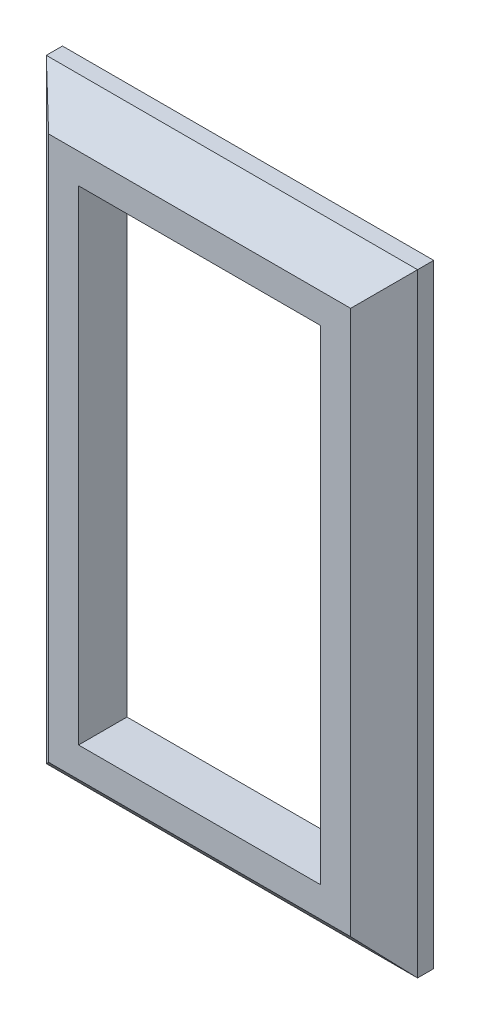
ISO-10303-21;
HEADER;
FILE_DESCRIPTION(('STEP AP214'),'2;1');
FILE_NAME('part.step','',(''),(''),'','','');
FILE_SCHEMA(('AUTOMOTIVE_DESIGN { 1 0 10303 214 1 1 1 1 }'));
ENDSEC;
DATA;
#1=APPLICATION_CONTEXT('core data for automotive mechanical design processes');
#2=APPLICATION_PROTOCOL_DEFINITION('international standard','automotive_design',2000,#1);
#3=PRODUCT_CONTEXT('',#1,'mechanical');
#4=PRODUCT('Part','Part','',(#3));
#5=PRODUCT_RELATED_PRODUCT_CATEGORY('part','',(#4));
#6=PRODUCT_DEFINITION_FORMATION('','',#4);
#7=PRODUCT_DEFINITION_CONTEXT('part definition',#1,'design');
#8=PRODUCT_DEFINITION('design','',#6,#7);
#9=PRODUCT_DEFINITION_SHAPE('','',#8);
#10=(LENGTH_UNIT() NAMED_UNIT(*) SI_UNIT(.MILLI.,.METRE.));
#11=(NAMED_UNIT(*) PLANE_ANGLE_UNIT() SI_UNIT($,.RADIAN.));
#12=(NAMED_UNIT(*) SI_UNIT($,.STERADIAN.) SOLID_ANGLE_UNIT());
#13=UNCERTAINTY_MEASURE_WITH_UNIT(LENGTH_MEASURE(1.E-05),#10,'distance_accuracy_value','');
#14=(GEOMETRIC_REPRESENTATION_CONTEXT(3) GLOBAL_UNCERTAINTY_ASSIGNED_CONTEXT((#13)) GLOBAL_UNIT_ASSIGNED_CONTEXT((#10,
#11,#12)) REPRESENTATION_CONTEXT('',''));
#15=CARTESIAN_POINT('',(0.,0.,0.));
#16=DIRECTION('',(0.,0.,1.));
#17=DIRECTION('',(1.,0.,0.));
#18=AXIS2_PLACEMENT_3D('',#15,#16,#17);
#19=CARTESIAN_POINT('',(0.,0.,3.));
#20=DIRECTION('',(0.,0.,1.));
#21=DIRECTION('',(1.,0.,0.));
#22=AXIS2_PLACEMENT_3D('',#19,#20,#21);
#23=PLANE('',#22);
#24=DIRECTION('',(0.,1.,0.));
#25=VECTOR('',#24,1.);
#26=CARTESIAN_POINT('',(9.35526257995064,19.,3.));
#27=LINE('',#26,#25);
#28=CARTESIAN_POINT('',(9.35526257995064,-16.8552625799506,3.));
#29=VERTEX_POINT('',#28);
#30=CARTESIAN_POINT('',(9.35526257995064,16.8552625799506,3.));
#31=VERTEX_POINT('',#30);
#32=EDGE_CURVE('E183',#29,#31,#27,.T.);
#33=ORIENTED_EDGE('',*,*,#32,.T.);
#34=DIRECTION('',(-1.,0.,0.));
#35=VECTOR('',#34,1.);
#36=CARTESIAN_POINT('',(-11.5,16.8552625799506,3.));
#37=LINE('',#36,#35);
#38=CARTESIAN_POINT('',(-9.35526257995063,16.8552625799506,3.));
#39=VERTEX_POINT('',#38);
#40=EDGE_CURVE('E185',#31,#39,#37,.T.);
#41=ORIENTED_EDGE('',*,*,#40,.T.);
#42=DIRECTION('',(0.,-1.,0.));
#43=VECTOR('',#42,1.);
#44=CARTESIAN_POINT('',(-9.35526257995063,-19.,3.));
#45=LINE('',#44,#43);
#46=CARTESIAN_POINT('',(-9.35526257995063,-16.8552625799507,3.));
#47=VERTEX_POINT('',#46);
#48=EDGE_CURVE('E179',#39,#47,#45,.T.);
#49=ORIENTED_EDGE('',*,*,#48,.T.);
#50=DIRECTION('',(1.,0.,0.));
#51=VECTOR('',#50,1.);
#52=CARTESIAN_POINT('',(11.5,-16.8552625799506,3.));
#53=LINE('',#52,#51);
#54=EDGE_CURVE('E181',#47,#29,#53,.T.);
#55=ORIENTED_EDGE('',*,*,#54,.T.);
#56=EDGE_LOOP('',(#33,#41,#49,#55));
#57=FACE_BOUND('',#56,.T.);
#58=DIRECTION('',(1.,0.,0.));
#59=VECTOR('',#58,1.);
#60=CARTESIAN_POINT('',(7.49999999999999,-15.,3.));
#61=LINE('',#60,#59);
#62=CARTESIAN_POINT('',(-7.50000000000001,-15.,3.));
#63=VERTEX_POINT('',#62);
#64=CARTESIAN_POINT('',(7.49999999999999,-15.,3.));
#65=VERTEX_POINT('',#64);
#66=EDGE_CURVE('E129',#63,#65,#61,.T.);
#67=ORIENTED_EDGE('',*,*,#66,.F.);
#68=DIRECTION('',(0.,-1.,0.));
#69=VECTOR('',#68,1.);
#70=CARTESIAN_POINT('',(-7.50000000000001,-15.,3.));
#71=LINE('',#70,#69);
#72=CARTESIAN_POINT('',(-7.50000000000001,15.,3.));
#73=VERTEX_POINT('',#72);
#74=EDGE_CURVE('E119',#73,#63,#71,.T.);
#75=ORIENTED_EDGE('',*,*,#74,.F.);
#76=DIRECTION('',(-1.,0.,0.));
#77=VECTOR('',#76,1.);
#78=CARTESIAN_POINT('',(7.49999999999999,15.,3.));
#79=LINE('',#78,#77);
#80=CARTESIAN_POINT('',(7.49999999999999,15.,3.));
#81=VERTEX_POINT('',#80);
#82=EDGE_CURVE('E144',#81,#73,#79,.T.);
#83=ORIENTED_EDGE('',*,*,#82,.F.);
#84=DIRECTION('',(0.,1.,0.));
#85=VECTOR('',#84,1.);
#86=CARTESIAN_POINT('',(7.49999999999999,-15.,3.));
#87=LINE('',#86,#85);
#88=EDGE_CURVE('E142',#65,#81,#87,.T.);
#89=ORIENTED_EDGE('',*,*,#88,.F.);
#90=EDGE_LOOP('',(#67,#75,#83,#89));
#91=FACE_BOUND('',#90,.T.);
#92=ADVANCED_FACE('F39',(#57,#91),#23,.T.);
#93=CARTESIAN_POINT('',(0.,0.,0.));
#94=DIRECTION('',(0.,0.,1.));
#95=DIRECTION('',(1.,0.,0.));
#96=AXIS2_PLACEMENT_3D('',#93,#94,#95);
#97=PLANE('',#96);
#98=DIRECTION('',(0.,-1.,0.));
#99=VECTOR('',#98,1.);
#100=CARTESIAN_POINT('',(-11.5,-19.,0.));
#101=LINE('',#100,#99);
#102=CARTESIAN_POINT('',(-11.5,19.,0.));
#103=VERTEX_POINT('',#102);
#104=CARTESIAN_POINT('',(-11.5,-19.,0.));
#105=VERTEX_POINT('',#104);
#106=EDGE_CURVE('E137',#103,#105,#101,.T.);
#107=ORIENTED_EDGE('',*,*,#106,.F.);
#108=DIRECTION('',(-1.,0.,0.));
#109=VECTOR('',#108,1.);
#110=CARTESIAN_POINT('',(11.5,19.,0.));
#111=LINE('',#110,#109);
#112=CARTESIAN_POINT('',(11.5,19.,0.));
#113=VERTEX_POINT('',#112);
#114=EDGE_CURVE('E168',#113,#103,#111,.T.);
#115=ORIENTED_EDGE('',*,*,#114,.F.);
#116=DIRECTION('',(0.,1.,0.));
#117=VECTOR('',#116,1.);
#118=CARTESIAN_POINT('',(11.5,-19.,0.));
#119=LINE('',#118,#117);
#120=CARTESIAN_POINT('',(11.5,-19.,0.));
#121=VERTEX_POINT('',#120);
#122=EDGE_CURVE('E165',#121,#113,#119,.T.);
#123=ORIENTED_EDGE('',*,*,#122,.F.);
#124=DIRECTION('',(1.,0.,0.));
#125=VECTOR('',#124,1.);
#126=CARTESIAN_POINT('',(11.5,-19.,0.));
#127=LINE('',#126,#125);
#128=EDGE_CURVE('E162',#105,#121,#127,.T.);
#129=ORIENTED_EDGE('',*,*,#128,.F.);
#130=EDGE_LOOP('',(#107,#115,#123,#129));
#131=FACE_BOUND('',#130,.T.);
#132=DIRECTION('',(0.,-1.,0.));
#133=VECTOR('',#132,1.);
#134=CARTESIAN_POINT('',(-7.50000000000001,-15.,0.));
#135=LINE('',#134,#133);
#136=CARTESIAN_POINT('',(-7.50000000000001,15.,0.));
#137=VERTEX_POINT('',#136);
#138=CARTESIAN_POINT('',(-7.50000000000001,-15.,0.));
#139=VERTEX_POINT('',#138);
#140=EDGE_CURVE('E148',#137,#139,#135,.T.);
#141=ORIENTED_EDGE('',*,*,#140,.T.);
#142=DIRECTION('',(1.,0.,0.));
#143=VECTOR('',#142,1.);
#144=CARTESIAN_POINT('',(7.49999999999999,-15.,0.));
#145=LINE('',#144,#143);
#146=CARTESIAN_POINT('',(7.49999999999999,-15.,0.));
#147=VERTEX_POINT('',#146);
#148=EDGE_CURVE('E136',#139,#147,#145,.T.);
#149=ORIENTED_EDGE('',*,*,#148,.T.);
#150=DIRECTION('',(0.,1.,0.));
#151=VECTOR('',#150,1.);
#152=CARTESIAN_POINT('',(7.49999999999999,-15.,0.));
#153=LINE('',#152,#151);
#154=CARTESIAN_POINT('',(7.49999999999999,15.,0.));
#155=VERTEX_POINT('',#154);
#156=EDGE_CURVE('E151',#147,#155,#153,.T.);
#157=ORIENTED_EDGE('',*,*,#156,.T.);
#158=DIRECTION('',(-1.,0.,0.));
#159=VECTOR('',#158,1.);
#160=CARTESIAN_POINT('',(7.49999999999999,15.,0.));
#161=LINE('',#160,#159);
#162=EDGE_CURVE('E130',#155,#137,#161,.T.);
#163=ORIENTED_EDGE('',*,*,#162,.T.);
#164=EDGE_LOOP('',(#141,#149,#157,#163));
#165=FACE_BOUND('',#164,.T.);
#166=ADVANCED_FACE('F225',(#131,#165),#97,.F.);
#167=CARTESIAN_POINT('',(-11.5,-19.,3.));
#168=DIRECTION('',(1.,0.,0.));
#169=DIRECTION('',(0.,0.,-1.));
#170=AXIS2_PLACEMENT_3D('',#167,#168,#169);
#171=PLANE('',#170);
#172=DIRECTION('',(0.,0.,-1.));
#173=VECTOR('',#172,1.);
#174=CARTESIAN_POINT('',(-11.5,-19.,3.));
#175=LINE('',#174,#173);
#176=CARTESIAN_POINT('',(-11.5,-19.,0.999999999999991));
#177=VERTEX_POINT('',#176);
#178=EDGE_CURVE('E177',#177,#105,#175,.T.);
#179=ORIENTED_EDGE('',*,*,#178,.F.);
#180=DIRECTION('',(0.,1.,0.));
#181=VECTOR('',#180,1.);
#182=CARTESIAN_POINT('',(-11.5,19.,0.999999999999991));
#183=LINE('',#182,#181);
#184=CARTESIAN_POINT('',(-11.5,19.,0.999999999999991));
#185=VERTEX_POINT('',#184);
#186=EDGE_CURVE('E11',#177,#185,#183,.T.);
#187=ORIENTED_EDGE('',*,*,#186,.T.);
#188=DIRECTION('',(0.,0.,-1.));
#189=VECTOR('',#188,1.);
#190=CARTESIAN_POINT('',(-11.5,19.,3.));
#191=LINE('',#190,#189);
#192=EDGE_CURVE('E171',#185,#103,#191,.T.);
#193=ORIENTED_EDGE('',*,*,#192,.T.);
#194=ORIENTED_EDGE('',*,*,#106,.T.);
#195=EDGE_LOOP('',(#179,#187,#193,#194));
#196=FACE_BOUND('',#195,.T.);
#197=ADVANCED_FACE('F214',(#196),#171,.F.);
#198=CARTESIAN_POINT('',(11.5,-19.,3.));
#199=DIRECTION('',(0.,1.,0.));
#200=DIRECTION('',(-1.,0.,0.));
#201=AXIS2_PLACEMENT_3D('',#198,#199,#200);
#202=PLANE('',#201);
#203=DIRECTION('',(0.,0.,-1.));
#204=VECTOR('',#203,1.);
#205=CARTESIAN_POINT('',(11.5,-19.,3.));
#206=LINE('',#205,#204);
#207=CARTESIAN_POINT('',(11.5,-19.,0.999999999999991));
#208=VERTEX_POINT('',#207);
#209=EDGE_CURVE('E175',#208,#121,#206,.T.);
#210=ORIENTED_EDGE('',*,*,#209,.F.);
#211=DIRECTION('',(-1.,0.,0.));
#212=VECTOR('',#211,1.);
#213=CARTESIAN_POINT('',(-11.5,-19.,0.999999999999991));
#214=LINE('',#213,#212);
#215=EDGE_CURVE('E49',#208,#177,#214,.T.);
#216=ORIENTED_EDGE('',*,*,#215,.T.);
#217=ORIENTED_EDGE('',*,*,#178,.T.);
#218=ORIENTED_EDGE('',*,*,#128,.T.);
#219=EDGE_LOOP('',(#210,#216,#217,#218));
#220=FACE_BOUND('',#219,.T.);
#221=ADVANCED_FACE('F240',(#220),#202,.F.);
#222=CARTESIAN_POINT('',(11.5,-19.,3.));
#223=DIRECTION('',(-1.,0.,0.));
#224=DIRECTION('',(0.,0.,1.));
#225=AXIS2_PLACEMENT_3D('',#222,#223,#224);
#226=PLANE('',#225);
#227=DIRECTION('',(0.,0.,-1.));
#228=VECTOR('',#227,1.);
#229=CARTESIAN_POINT('',(11.5,19.,3.));
#230=LINE('',#229,#228);
#231=CARTESIAN_POINT('',(11.5,19.,0.999999999999991));
#232=VERTEX_POINT('',#231);
#233=EDGE_CURVE('E173',#232,#113,#230,.T.);
#234=ORIENTED_EDGE('',*,*,#233,.F.);
#235=DIRECTION('',(0.,-1.,0.));
#236=VECTOR('',#235,1.);
#237=CARTESIAN_POINT('',(11.5,-19.,0.999999999999991));
#238=LINE('',#237,#236);
#239=EDGE_CURVE('E64',#232,#208,#238,.T.);
#240=ORIENTED_EDGE('',*,*,#239,.T.);
#241=ORIENTED_EDGE('',*,*,#209,.T.);
#242=ORIENTED_EDGE('',*,*,#122,.T.);
#243=EDGE_LOOP('',(#234,#240,#241,#242));
#244=FACE_BOUND('',#243,.T.);
#245=ADVANCED_FACE('F237',(#244),#226,.F.);
#246=CARTESIAN_POINT('',(11.5,19.,3.));
#247=DIRECTION('',(0.,-1.,0.));
#248=DIRECTION('',(1.,0.,0.));
#249=AXIS2_PLACEMENT_3D('',#246,#247,#248);
#250=PLANE('',#249);
#251=ORIENTED_EDGE('',*,*,#192,.F.);
#252=DIRECTION('',(1.,0.,0.));
#253=VECTOR('',#252,1.);
#254=CARTESIAN_POINT('',(11.5,19.,0.999999999999991));
#255=LINE('',#254,#253);
#256=EDGE_CURVE('E188',#185,#232,#255,.T.);
#257=ORIENTED_EDGE('',*,*,#256,.T.);
#258=ORIENTED_EDGE('',*,*,#233,.T.);
#259=ORIENTED_EDGE('',*,*,#114,.T.);
#260=EDGE_LOOP('',(#251,#257,#258,#259));
#261=FACE_BOUND('',#260,.T.);
#262=ADVANCED_FACE('F217',(#261),#250,.F.);
#263=CARTESIAN_POINT('',(-7.50000000000001,-15.,3.));
#264=DIRECTION('',(1.,0.,0.));
#265=DIRECTION('',(0.,0.,-1.));
#266=AXIS2_PLACEMENT_3D('',#263,#264,#265);
#267=PLANE('',#266);
#268=ORIENTED_EDGE('',*,*,#140,.F.);
#269=DIRECTION('',(0.,0.,-1.));
#270=VECTOR('',#269,1.);
#271=CARTESIAN_POINT('',(-7.50000000000001,15.,3.));
#272=LINE('',#271,#270);
#273=EDGE_CURVE('E125',#73,#137,#272,.T.);
#274=ORIENTED_EDGE('',*,*,#273,.F.);
#275=ORIENTED_EDGE('',*,*,#74,.T.);
#276=DIRECTION('',(0.,0.,-1.));
#277=VECTOR('',#276,1.);
#278=CARTESIAN_POINT('',(-7.50000000000001,-15.,3.));
#279=LINE('',#278,#277);
#280=EDGE_CURVE('E122',#63,#139,#279,.T.);
#281=ORIENTED_EDGE('',*,*,#280,.T.);
#282=EDGE_LOOP('',(#268,#274,#275,#281));
#283=FACE_BOUND('',#282,.T.);
#284=ADVANCED_FACE('F121',(#283),#267,.T.);
#285=CARTESIAN_POINT('',(7.49999999999999,-15.,3.));
#286=DIRECTION('',(0.,1.,0.));
#287=DIRECTION('',(-1.,0.,0.));
#288=AXIS2_PLACEMENT_3D('',#285,#286,#287);
#289=PLANE('',#288);
#290=ORIENTED_EDGE('',*,*,#148,.F.);
#291=ORIENTED_EDGE('',*,*,#280,.F.);
#292=ORIENTED_EDGE('',*,*,#66,.T.);
#293=DIRECTION('',(0.,0.,-1.));
#294=VECTOR('',#293,1.);
#295=CARTESIAN_POINT('',(7.49999999999999,-15.,3.));
#296=LINE('',#295,#294);
#297=EDGE_CURVE('E138',#65,#147,#296,.T.);
#298=ORIENTED_EDGE('',*,*,#297,.T.);
#299=EDGE_LOOP('',(#290,#291,#292,#298));
#300=FACE_BOUND('',#299,.T.);
#301=ADVANCED_FACE('F133',(#300),#289,.T.);
#302=CARTESIAN_POINT('',(7.49999999999999,-15.,3.));
#303=DIRECTION('',(-1.,0.,0.));
#304=DIRECTION('',(0.,0.,1.));
#305=AXIS2_PLACEMENT_3D('',#302,#303,#304);
#306=PLANE('',#305);
#307=ORIENTED_EDGE('',*,*,#156,.F.);
#308=ORIENTED_EDGE('',*,*,#297,.F.);
#309=ORIENTED_EDGE('',*,*,#88,.T.);
#310=DIRECTION('',(0.,0.,-1.));
#311=VECTOR('',#310,1.);
#312=CARTESIAN_POINT('',(7.49999999999999,15.,3.));
#313=LINE('',#312,#311);
#314=EDGE_CURVE('E157',#81,#155,#313,.T.);
#315=ORIENTED_EDGE('',*,*,#314,.T.);
#316=EDGE_LOOP('',(#307,#308,#309,#315));
#317=FACE_BOUND('',#316,.T.);
#318=ADVANCED_FACE('F265',(#317),#306,.T.);
#319=CARTESIAN_POINT('',(7.49999999999999,15.,3.));
#320=DIRECTION('',(0.,-1.,0.));
#321=DIRECTION('',(1.,0.,0.));
#322=AXIS2_PLACEMENT_3D('',#319,#320,#321);
#323=PLANE('',#322);
#324=ORIENTED_EDGE('',*,*,#162,.F.);
#325=ORIENTED_EDGE('',*,*,#314,.F.);
#326=ORIENTED_EDGE('',*,*,#82,.T.);
#327=ORIENTED_EDGE('',*,*,#273,.T.);
#328=EDGE_LOOP('',(#324,#325,#326,#327));
#329=FACE_BOUND('',#328,.T.);
#330=ADVANCED_FACE('F261',(#329),#323,.T.);
#331=CARTESIAN_POINT('',(0.,-16.8552625799507,3.));
#332=DIRECTION('',(0.,-0.6819983600625,0.731353701619169));
#333=DIRECTION('',(-1.,0.,0.));
#334=AXIS2_PLACEMENT_3D('',#331,#332,#333);
#335=PLANE('',#334);
#336=DIRECTION('',(0.590324081032979,0.590324081032979,0.550486111273607));
#337=VECTOR('',#336,1.);
#338=CARTESIAN_POINT('',(-3.48149818991511,-10.9814981899151,8.47737390612633));
#339=LINE('',#338,#337);
#340=EDGE_CURVE('E196',#177,#47,#339,.T.);
#341=ORIENTED_EDGE('',*,*,#340,.F.);
#342=ORIENTED_EDGE('',*,*,#215,.F.);
#343=DIRECTION('',(-0.590324081032979,0.590324081032979,0.550486111273607));
#344=VECTOR('',#343,1.);
#345=CARTESIAN_POINT('',(6.09511709477085,-13.5951170947709,6.04013484793375));
#346=LINE('',#345,#344);
#347=EDGE_CURVE('E44',#29,#208,#346,.F.);
#348=ORIENTED_EDGE('',*,*,#347,.F.);
#349=ORIENTED_EDGE('',*,*,#54,.F.);
#350=EDGE_LOOP('',(#341,#342,#348,#349));
#351=FACE_BOUND('',#350,.T.);
#352=ADVANCED_FACE('F42',(#351),#335,.T.);
#353=CARTESIAN_POINT('',(9.35526257995064,0.,3.));
#354=DIRECTION('',(0.6819983600625,0.,0.731353701619169));
#355=DIRECTION('',(0.,-1.,0.));
#356=AXIS2_PLACEMENT_3D('',#353,#354,#355);
#357=PLANE('',#356);
#358=ORIENTED_EDGE('',*,*,#347,.T.);
#359=ORIENTED_EDGE('',*,*,#239,.F.);
#360=DIRECTION('',(-0.590324081032979,-0.590324081032979,0.550486111273607));
#361=VECTOR('',#360,1.);
#362=CARTESIAN_POINT('',(3.48149818991512,10.9814981899151,8.47737390612632));
#363=LINE('',#362,#361);
#364=EDGE_CURVE('E195',#31,#232,#363,.F.);
#365=ORIENTED_EDGE('',*,*,#364,.F.);
#366=ORIENTED_EDGE('',*,*,#32,.F.);
#367=EDGE_LOOP('',(#358,#359,#365,#366));
#368=FACE_BOUND('',#367,.T.);
#369=ADVANCED_FACE('F206',(#368),#357,.T.);
#370=CARTESIAN_POINT('',(-9.35526257995063,0.,3.));
#371=DIRECTION('',(-0.6819983600625,0.,0.731353701619169));
#372=DIRECTION('',(0.,1.,0.));
#373=AXIS2_PLACEMENT_3D('',#370,#371,#372);
#374=PLANE('',#373);
#375=ORIENTED_EDGE('',*,*,#340,.T.);
#376=ORIENTED_EDGE('',*,*,#48,.F.);
#377=DIRECTION('',(-0.590324081032979,0.590324081032978,-0.550486111273607));
#378=VECTOR('',#377,1.);
#379=CARTESIAN_POINT('',(-3.48149818991512,10.9814981899151,8.47737390612632));
#380=LINE('',#379,#378);
#381=EDGE_CURVE('E193',#185,#39,#380,.F.);
#382=ORIENTED_EDGE('',*,*,#381,.F.);
#383=ORIENTED_EDGE('',*,*,#186,.F.);
#384=EDGE_LOOP('',(#375,#376,#382,#383));
#385=FACE_BOUND('',#384,.T.);
#386=ADVANCED_FACE('F211',(#385),#374,.T.);
#387=CARTESIAN_POINT('',(0.,16.8552625799506,3.));
#388=DIRECTION('',(0.,0.681998360062501,0.731353701619169));
#389=DIRECTION('',(1.,0.,0.));
#390=AXIS2_PLACEMENT_3D('',#387,#388,#389);
#391=PLANE('',#390);
#392=ORIENTED_EDGE('',*,*,#364,.T.);
#393=ORIENTED_EDGE('',*,*,#256,.F.);
#394=ORIENTED_EDGE('',*,*,#381,.T.);
#395=ORIENTED_EDGE('',*,*,#40,.F.);
#396=EDGE_LOOP('',(#392,#393,#394,#395));
#397=FACE_BOUND('',#396,.T.);
#398=ADVANCED_FACE('F221',(#397),#391,.T.);
#399=CLOSED_SHELL('',(#92,#166,#197,#221,#245,#262,#284,#301,#318,#330,#352,#369,#386,#398));
#400=MANIFOLD_SOLID_BREP('B2',#399);
#401=ADVANCED_BREP_SHAPE_REPRESENTATION('',(#18,#400),#14);
#402=SHAPE_DEFINITION_REPRESENTATION(#9,#401);
ENDSEC;
END-ISO-10303-21;
